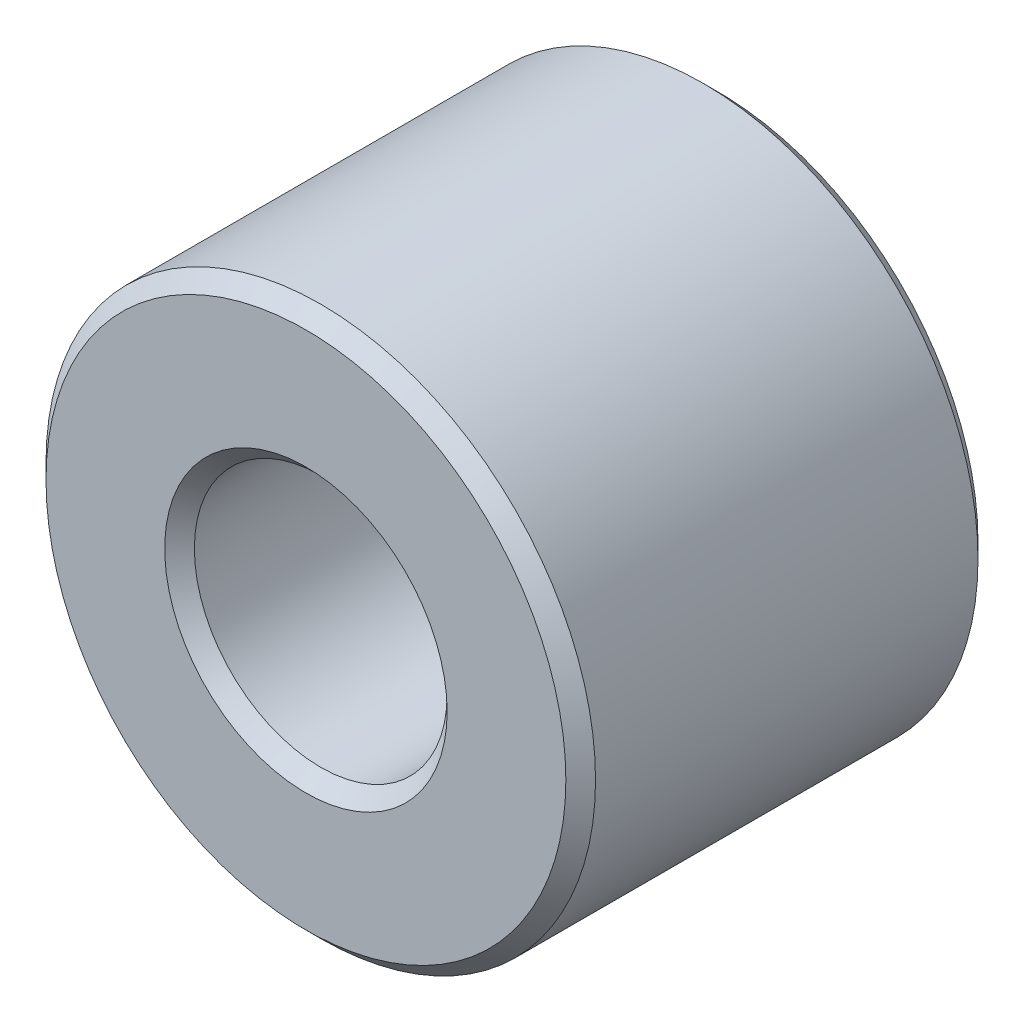
ISO-10303-21;
HEADER;
FILE_DESCRIPTION(('STEP AP214'),'2;1');
FILE_NAME('part.step','',(''),(''),'','','');
FILE_SCHEMA(('AUTOMOTIVE_DESIGN { 1 0 10303 214 1 1 1 1 }'));
ENDSEC;
DATA;
#1=APPLICATION_CONTEXT('core data for automotive mechanical design processes');
#2=APPLICATION_PROTOCOL_DEFINITION('international standard','automotive_design',2000,#1);
#3=PRODUCT_CONTEXT('',#1,'mechanical');
#4=PRODUCT('Part','Part','',(#3));
#5=PRODUCT_RELATED_PRODUCT_CATEGORY('part','',(#4));
#6=PRODUCT_DEFINITION_FORMATION('','',#4);
#7=PRODUCT_DEFINITION_CONTEXT('part definition',#1,'design');
#8=PRODUCT_DEFINITION('design','',#6,#7);
#9=PRODUCT_DEFINITION_SHAPE('','',#8);
#10=(LENGTH_UNIT() NAMED_UNIT(*) SI_UNIT(.MILLI.,.METRE.));
#11=(NAMED_UNIT(*) PLANE_ANGLE_UNIT() SI_UNIT($,.RADIAN.));
#12=(NAMED_UNIT(*) SI_UNIT($,.STERADIAN.) SOLID_ANGLE_UNIT());
#13=UNCERTAINTY_MEASURE_WITH_UNIT(LENGTH_MEASURE(1.E-05),#10,'distance_accuracy_value','');
#14=(GEOMETRIC_REPRESENTATION_CONTEXT(3) GLOBAL_UNCERTAINTY_ASSIGNED_CONTEXT((#13)) GLOBAL_UNIT_ASSIGNED_CONTEXT((#10,
#11,#12)) REPRESENTATION_CONTEXT('',''));
#15=CARTESIAN_POINT('',(0.,0.,0.));
#16=DIRECTION('',(0.,0.,1.));
#17=DIRECTION('',(1.,0.,0.));
#18=AXIS2_PLACEMENT_3D('',#15,#16,#17);
#19=CARTESIAN_POINT('',(0.,0.,-2.38125));
#20=DIRECTION('',(0.,0.,1.));
#21=DIRECTION('',(1.,0.,0.));
#22=AXIS2_PLACEMENT_3D('',#19,#20,#21);
#23=CYLINDRICAL_SURFACE('',#22,3.175);
#24=CARTESIAN_POINT('',(0.,0.,2.2098));
#25=DIRECTION('',(0.,0.,1.));
#26=DIRECTION('',(1.,0.,0.));
#27=AXIS2_PLACEMENT_3D('',#24,#25,#26);
#28=CIRCLE('',#27,3.175);
#29=CARTESIAN_POINT('',(3.175,0.,2.2098));
#30=VERTEX_POINT('',#29);
#31=EDGE_CURVE('E50',#30,#30,#28,.F.);
#32=ORIENTED_EDGE('',*,*,#31,.T.);
#33=EDGE_LOOP('',(#32));
#34=FACE_BOUND('',#33,.T.);
#35=CARTESIAN_POINT('',(0.,0.,-2.2098));
#36=DIRECTION('',(0.,0.,1.));
#37=DIRECTION('',(1.,0.,0.));
#38=AXIS2_PLACEMENT_3D('',#35,#36,#37);
#39=CIRCLE('',#38,3.175);
#40=CARTESIAN_POINT('',(3.175,0.,-2.2098));
#41=VERTEX_POINT('',#40);
#42=EDGE_CURVE('E53',#41,#41,#39,.T.);
#43=ORIENTED_EDGE('',*,*,#42,.T.);
#44=EDGE_LOOP('',(#43));
#45=FACE_BOUND('',#44,.T.);
#46=ADVANCED_FACE('F30',(#34,#45),#23,.T.);
#47=CARTESIAN_POINT('',(0.,0.,-2.38125));
#48=DIRECTION('',(0.,0.,1.));
#49=DIRECTION('',(1.,0.,0.));
#50=AXIS2_PLACEMENT_3D('',#47,#48,#49);
#51=PLANE('',#50);
#52=CARTESIAN_POINT('',(0.,0.,-2.38125));
#53=DIRECTION('',(0.,0.,1.));
#54=DIRECTION('',(1.,0.,0.));
#55=AXIS2_PLACEMENT_3D('',#52,#53,#54);
#56=CIRCLE('',#55,3.00355);
#57=CARTESIAN_POINT('',(3.00355,0.,-2.38125));
#58=VERTEX_POINT('',#57);
#59=EDGE_CURVE('E41',#58,#58,#56,.F.);
#60=ORIENTED_EDGE('',*,*,#59,.T.);
#61=EDGE_LOOP('',(#60));
#62=FACE_BOUND('',#61,.T.);
#63=CARTESIAN_POINT('',(0.,0.,-2.38125));
#64=DIRECTION('',(0.,0.,1.));
#65=DIRECTION('',(1.,0.,0.));
#66=AXIS2_PLACEMENT_3D('',#63,#64,#65);
#67=CIRCLE('',#66,1.63195);
#68=CARTESIAN_POINT('',(1.63195,0.,-2.38125));
#69=VERTEX_POINT('',#68);
#70=EDGE_CURVE('E45',#69,#69,#67,.T.);
#71=ORIENTED_EDGE('',*,*,#70,.T.);
#72=EDGE_LOOP('',(#71));
#73=FACE_BOUND('',#72,.T.);
#74=ADVANCED_FACE('F78',(#62,#73),#51,.F.);
#75=CARTESIAN_POINT('',(0.,0.,-2.38125));
#76=DIRECTION('',(0.,0.,1.));
#77=DIRECTION('',(1.,0.,0.));
#78=AXIS2_PLACEMENT_3D('',#75,#76,#77);
#79=CYLINDRICAL_SURFACE('',#78,1.4605);
#80=CARTESIAN_POINT('',(0.,0.,2.2098));
#81=DIRECTION('',(0.,0.,1.));
#82=DIRECTION('',(1.,0.,0.));
#83=AXIS2_PLACEMENT_3D('',#80,#81,#82);
#84=CIRCLE('',#83,1.4605);
#85=CARTESIAN_POINT('',(1.4605,0.,2.2098));
#86=VERTEX_POINT('',#85);
#87=EDGE_CURVE('E10',#86,#86,#84,.T.);
#88=ORIENTED_EDGE('',*,*,#87,.T.);
#89=EDGE_LOOP('',(#88));
#90=FACE_BOUND('',#89,.T.);
#91=CARTESIAN_POINT('',(0.,0.,-2.2098));
#92=DIRECTION('',(0.,0.,1.));
#93=DIRECTION('',(1.,0.,0.));
#94=AXIS2_PLACEMENT_3D('',#91,#92,#93);
#95=CIRCLE('',#94,1.4605);
#96=CARTESIAN_POINT('',(1.4605,0.,-2.2098));
#97=VERTEX_POINT('',#96);
#98=EDGE_CURVE('E37',#97,#97,#95,.F.);
#99=ORIENTED_EDGE('',*,*,#98,.T.);
#100=EDGE_LOOP('',(#99));
#101=FACE_BOUND('',#100,.T.);
#102=ADVANCED_FACE('F84',(#90,#101),#79,.F.);
#103=CARTESIAN_POINT('',(0.,0.,2.38125));
#104=DIRECTION('',(0.,0.,1.));
#105=DIRECTION('',(1.,0.,0.));
#106=AXIS2_PLACEMENT_3D('',#103,#104,#105);
#107=PLANE('',#106);
#108=CARTESIAN_POINT('',(0.,0.,2.38125));
#109=DIRECTION('',(0.,0.,1.));
#110=DIRECTION('',(1.,0.,0.));
#111=AXIS2_PLACEMENT_3D('',#108,#109,#110);
#112=CIRCLE('',#111,3.00355);
#113=CARTESIAN_POINT('',(3.00355,0.,2.38125));
#114=VERTEX_POINT('',#113);
#115=EDGE_CURVE('E56',#114,#114,#112,.T.);
#116=ORIENTED_EDGE('',*,*,#115,.T.);
#117=EDGE_LOOP('',(#116));
#118=FACE_BOUND('',#117,.T.);
#119=CARTESIAN_POINT('',(0.,0.,2.38125));
#120=DIRECTION('',(0.,0.,1.));
#121=DIRECTION('',(1.,0.,0.));
#122=AXIS2_PLACEMENT_3D('',#119,#120,#121);
#123=CIRCLE('',#122,1.63195);
#124=CARTESIAN_POINT('',(1.63195,0.,2.38125));
#125=VERTEX_POINT('',#124);
#126=EDGE_CURVE('E59',#125,#125,#123,.F.);
#127=ORIENTED_EDGE('',*,*,#126,.T.);
#128=EDGE_LOOP('',(#127));
#129=FACE_BOUND('',#128,.T.);
#130=ADVANCED_FACE('F63',(#118,#129),#107,.T.);
#131=CARTESIAN_POINT('',(0.,0.,2.38125));
#132=DIRECTION('',(0.,0.,-1.));
#133=DIRECTION('',(-1.,0.,0.));
#134=AXIS2_PLACEMENT_3D('',#131,#132,#133);
#135=CONICAL_SURFACE('',#134,3.00355,0.785398163397445);
#136=ORIENTED_EDGE('',*,*,#31,.F.);
#137=EDGE_LOOP('',(#136));
#138=FACE_BOUND('',#137,.T.);
#139=ORIENTED_EDGE('',*,*,#115,.F.);
#140=EDGE_LOOP('',(#139));
#141=FACE_BOUND('',#140,.T.);
#142=ADVANCED_FACE('F74',(#138,#141),#135,.T.);
#143=CARTESIAN_POINT('',(0.,0.,-2.2098));
#144=DIRECTION('',(0.,0.,1.));
#145=DIRECTION('',(1.,0.,0.));
#146=AXIS2_PLACEMENT_3D('',#143,#144,#145);
#147=CONICAL_SURFACE('',#146,3.175,0.785398163397448);
#148=ORIENTED_EDGE('',*,*,#59,.F.);
#149=EDGE_LOOP('',(#148));
#150=FACE_BOUND('',#149,.T.);
#151=ORIENTED_EDGE('',*,*,#42,.F.);
#152=EDGE_LOOP('',(#151));
#153=FACE_BOUND('',#152,.T.);
#154=ADVANCED_FACE('F68',(#150,#153),#147,.T.);
#155=CARTESIAN_POINT('',(0.,0.,2.2098));
#156=DIRECTION('',(0.,0.,1.));
#157=DIRECTION('',(1.,0.,0.));
#158=AXIS2_PLACEMENT_3D('',#155,#156,#157);
#159=CONICAL_SURFACE('',#158,1.4605,0.785398163397448);
#160=CARTESIAN_POINT('',(1.63195,0.,2.38125));
#161=CARTESIAN_POINT('',(1.6301640625,0.,2.3794640625));
#162=CARTESIAN_POINT('',(1.628378125,0.,2.377678125));
#163=CARTESIAN_POINT('',(1.62480625,0.,2.37410625));
#164=CARTESIAN_POINT('',(1.6230203125,0.,2.3723203125));
#165=CARTESIAN_POINT('',(1.6194484375,0.,2.3687484375));
#166=CARTESIAN_POINT('',(1.6176625,0.,2.3669625));
#167=CARTESIAN_POINT('',(1.614090625,0.,2.363390625));
#168=CARTESIAN_POINT('',(1.6123046875,0.,2.3616046875));
#169=CARTESIAN_POINT('',(1.6087328125,0.,2.3580328125));
#170=CARTESIAN_POINT('',(1.606946875,0.,2.356246875));
#171=CARTESIAN_POINT('',(1.603375,0.,2.352675));
#172=CARTESIAN_POINT('',(1.6015890625,0.,2.3508890625));
#173=CARTESIAN_POINT('',(1.5980171875,0.,2.3473171875));
#174=CARTESIAN_POINT('',(1.59623125,0.,2.34553125));
#175=CARTESIAN_POINT('',(1.592659375,0.,2.341959375));
#176=CARTESIAN_POINT('',(1.5908734375,0.,2.3401734375));
#177=CARTESIAN_POINT('',(1.5873015625,0.,2.3366015625));
#178=CARTESIAN_POINT('',(1.585515625,0.,2.334815625));
#179=CARTESIAN_POINT('',(1.58194375,0.,2.33124375));
#180=CARTESIAN_POINT('',(1.5801578125,0.,2.3294578125));
#181=CARTESIAN_POINT('',(1.5765859375,0.,2.3258859375));
#182=CARTESIAN_POINT('',(1.5748,0.,2.3241));
#183=CARTESIAN_POINT('',(1.571228125,0.,2.320528125));
#184=CARTESIAN_POINT('',(1.5694421875,0.,2.3187421875));
#185=CARTESIAN_POINT('',(1.5658703125,0.,2.3151703125));
#186=CARTESIAN_POINT('',(1.564084375,0.,2.313384375));
#187=CARTESIAN_POINT('',(1.5605125,0.,2.3098125));
#188=CARTESIAN_POINT('',(1.5587265625,0.,2.3080265625));
#189=CARTESIAN_POINT('',(1.5551546875,0.,2.3044546875));
#190=CARTESIAN_POINT('',(1.55336875,0.,2.30266875));
#191=CARTESIAN_POINT('',(1.549796875,0.,2.299096875));
#192=CARTESIAN_POINT('',(1.5480109375,0.,2.2973109375));
#193=CARTESIAN_POINT('',(1.5444390625,0.,2.2937390625));
#194=CARTESIAN_POINT('',(1.542653125,0.,2.291953125));
#195=CARTESIAN_POINT('',(1.53908125,0.,2.28838125));
#196=CARTESIAN_POINT('',(1.5372953125,0.,2.2865953125));
#197=CARTESIAN_POINT('',(1.5337234375,0.,2.2830234375));
#198=CARTESIAN_POINT('',(1.5319375,0.,2.2812375));
#199=CARTESIAN_POINT('',(1.528365625,0.,2.277665625));
#200=CARTESIAN_POINT('',(1.5265796875,0.,2.2758796875));
#201=CARTESIAN_POINT('',(1.5230078125,0.,2.2723078125));
#202=CARTESIAN_POINT('',(1.521221875,0.,2.270521875));
#203=CARTESIAN_POINT('',(1.51765,0.,2.26695));
#204=CARTESIAN_POINT('',(1.5158640625,0.,2.2651640625));
#205=CARTESIAN_POINT('',(1.5122921875,0.,2.2615921875));
#206=CARTESIAN_POINT('',(1.51050625,0.,2.25980625));
#207=CARTESIAN_POINT('',(1.506934375,0.,2.256234375));
#208=CARTESIAN_POINT('',(1.5051484375,0.,2.2544484375));
#209=CARTESIAN_POINT('',(1.5015765625,0.,2.2508765625));
#210=CARTESIAN_POINT('',(1.499790625,0.,2.249090625));
#211=CARTESIAN_POINT('',(1.49621875,0.,2.24551875));
#212=CARTESIAN_POINT('',(1.4944328125,0.,2.2437328125));
#213=CARTESIAN_POINT('',(1.4908609375,0.,2.2401609375));
#214=CARTESIAN_POINT('',(1.489075,0.,2.238375));
#215=CARTESIAN_POINT('',(1.485503125,0.,2.234803125));
#216=CARTESIAN_POINT('',(1.4837171875,0.,2.2330171875));
#217=CARTESIAN_POINT('',(1.4801453125,0.,2.2294453125));
#218=CARTESIAN_POINT('',(1.478359375,0.,2.227659375));
#219=CARTESIAN_POINT('',(1.4747875,0.,2.2240875));
#220=CARTESIAN_POINT('',(1.4730015625,0.,2.2223015625));
#221=CARTESIAN_POINT('',(1.4694296875,0.,2.2187296875));
#222=CARTESIAN_POINT('',(1.46764375,0.,2.21694375));
#223=CARTESIAN_POINT('',(1.464071875,0.,2.213371875));
#224=CARTESIAN_POINT('',(1.4622859375,0.,2.2115859375));
#225=CARTESIAN_POINT('',(1.4605,0.,2.2098));
#226=B_SPLINE_CURVE_WITH_KNOTS('',3,(#160,#161,#162,#163,#164,#165,#166,#167,#168,#169,#170,
#171,#172,#173,#174,#175,#176,#177,#178,#179,#180,#181,#182,#183,#184,#185,#186,#187,#188,#189,
#190,#191,#192,#193,#194,#195,#196,#197,#198,#199,#200,#201,#202,#203,#204,#205,#206,#207,#208,
#209,#210,#211,#212,#213,#214,#215,#216,#217,#218,#219,#220,#221,#222,#223,#224,#225),
.UNSPECIFIED.,.F.,.F.,(4,2,2,2,2,2,2,2,2,2,2,2,2,2,2,2,2,2,2,2,2,2,2,2,2,2,2,2,2,2,2,2,4),(0.,
0.0075770911021518,0.0151541822043041,0.0227312733064562,0.0303083644086079,0.0378854555107602,
0.0454625466129123,0.0530396377150643,0.0606167288172164,0.0681938199193685,0.0757709110215204,
0.0833480021236725,0.0909250932258248,0.0985021843279766,0.106079275430129,0.113656366532281,
0.121233457634433,0.128810548736585,0.136387639838737,0.143964730940889,0.151541822043041,
0.159118913145193,0.166696004247345,0.174273095349497,0.181850186451649,0.189427277553801,
0.197004368655953,0.204581459758106,0.212158550860258,0.21973564196241,0.227312733064562,
0.234889824166714,0.242466915268866),.UNSPECIFIED.);
#227=EDGE_CURVE('BSEAM65',#125,#86,#226,.T.);
#228=ORIENTED_EDGE('',*,*,#126,.F.);
#229=ORIENTED_EDGE('',*,*,#87,.F.);
#230=ORIENTED_EDGE('',*,*,#227,.T.);
#231=ORIENTED_EDGE('',*,*,#227,.F.);
#232=EDGE_LOOP('',(#228,#230,#229,#231));
#233=FACE_BOUND('',#232,.T.);
#234=ADVANCED_FACE('F65',(#233),#159,.F.);
#235=CARTESIAN_POINT('',(0.,0.,-2.38125));
#236=DIRECTION('',(0.,0.,-1.));
#237=DIRECTION('',(-1.,0.,0.));
#238=AXIS2_PLACEMENT_3D('',#235,#236,#237);
#239=CONICAL_SURFACE('',#238,1.63195,0.785398163397446);
#240=ORIENTED_EDGE('',*,*,#98,.F.);
#241=EDGE_LOOP('',(#240));
#242=FACE_BOUND('',#241,.T.);
#243=ORIENTED_EDGE('',*,*,#70,.F.);
#244=EDGE_LOOP('',(#243));
#245=FACE_BOUND('',#244,.T.);
#246=ADVANCED_FACE('F32',(#242,#245),#239,.F.);
#247=CLOSED_SHELL('',(#46,#74,#102,#130,#142,#154,#234,#246));
#248=MANIFOLD_SOLID_BREP('B2',#247);
#249=ADVANCED_BREP_SHAPE_REPRESENTATION('',(#18,#248),#14);
#250=SHAPE_DEFINITION_REPRESENTATION(#9,#249);
ENDSEC;
END-ISO-10303-21;
